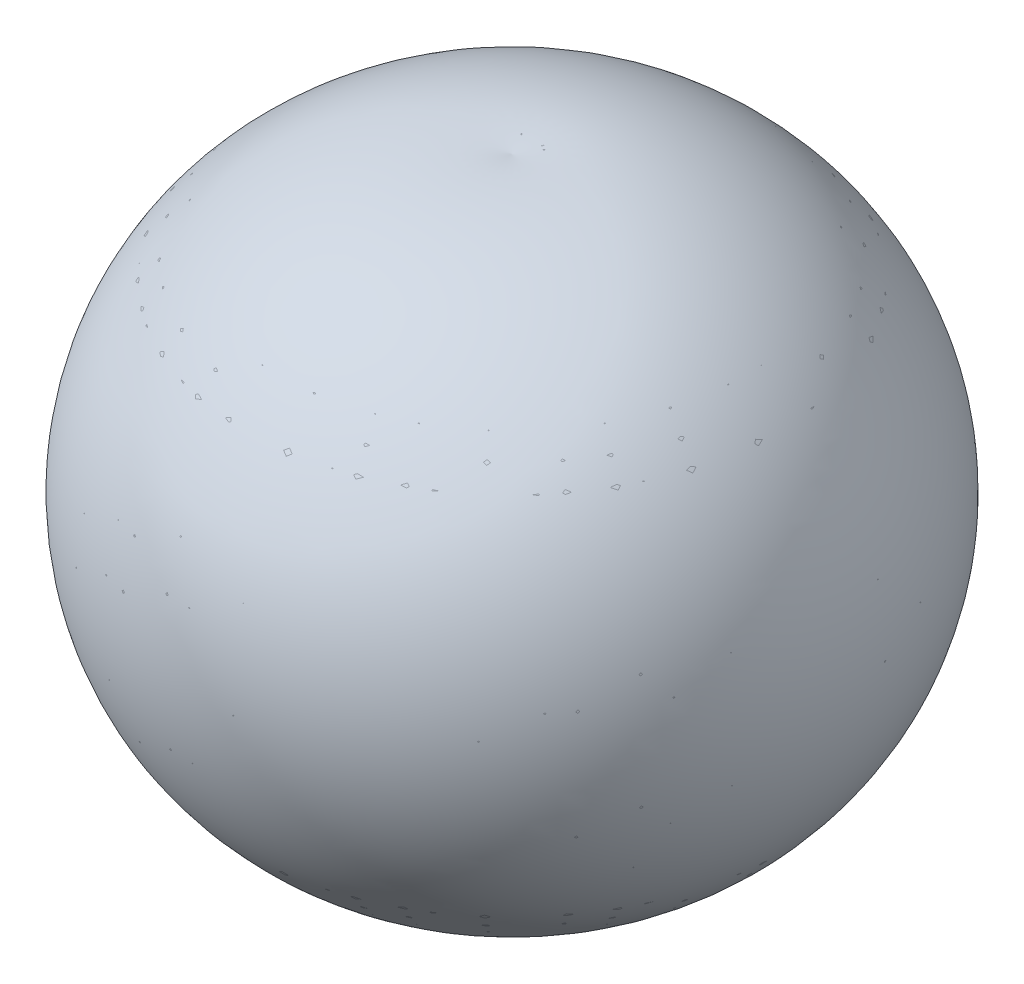
ISO-10303-21;
HEADER;
FILE_DESCRIPTION(('STEP AP214'),'2;1');
FILE_NAME('part.step','',(''),(''),'','','');
FILE_SCHEMA(('AUTOMOTIVE_DESIGN { 1 0 10303 214 1 1 1 1 }'));
ENDSEC;
DATA;
#1=APPLICATION_CONTEXT('core data for automotive mechanical design processes');
#2=APPLICATION_PROTOCOL_DEFINITION('international standard','automotive_design',2000,#1);
#3=PRODUCT_CONTEXT('',#1,'mechanical');
#4=PRODUCT('Part','Part','',(#3));
#5=PRODUCT_RELATED_PRODUCT_CATEGORY('part','',(#4));
#6=PRODUCT_DEFINITION_FORMATION('','',#4);
#7=PRODUCT_DEFINITION_CONTEXT('part definition',#1,'design');
#8=PRODUCT_DEFINITION('design','',#6,#7);
#9=PRODUCT_DEFINITION_SHAPE('','',#8);
#10=(LENGTH_UNIT() NAMED_UNIT(*) SI_UNIT(.MILLI.,.METRE.));
#11=(NAMED_UNIT(*) PLANE_ANGLE_UNIT() SI_UNIT($,.RADIAN.));
#12=(NAMED_UNIT(*) SI_UNIT($,.STERADIAN.) SOLID_ANGLE_UNIT());
#13=UNCERTAINTY_MEASURE_WITH_UNIT(LENGTH_MEASURE(1.E-05),#10,'distance_accuracy_value','');
#14=(GEOMETRIC_REPRESENTATION_CONTEXT(3) GLOBAL_UNCERTAINTY_ASSIGNED_CONTEXT((#13)) GLOBAL_UNIT_ASSIGNED_CONTEXT((#10,
#11,#12)) REPRESENTATION_CONTEXT('',''));
#15=CARTESIAN_POINT('',(0.,0.,0.));
#16=DIRECTION('',(0.,0.,1.));
#17=DIRECTION('',(1.,0.,0.));
#18=AXIS2_PLACEMENT_3D('',#15,#16,#17);
#19=CARTESIAN_POINT('',(0.,450.000001151964,0.));
#20=DIRECTION('',(0.,-1.,0.));
#21=DIRECTION('',(0.,0.,-1.));
#22=AXIS2_PLACEMENT_3D('',#19,#20,#21);
#23=DEGENERATE_TOROIDAL_SURFACE('',#22,149.999999332809,566.923540499677,.F.);
#24=CARTESIAN_POINT('',(0.,982.999252027794,0.));
#25=DIRECTION('',(0.,-1.,0.));
#26=DIRECTION('',(0.,0.,-1.));
#27=AXIS2_PLACEMENT_3D('',#24,#25,#26);
#28=CIRCLE('',#27,43.1685781804391);
#29=CARTESIAN_POINT('',(0.,982.999252027794,-43.1685781804391));
#30=VERTEX_POINT('',#29);
#31=EDGE_CURVE('E61',#30,#30,#28,.T.);
#32=ORIENTED_EDGE('',*,*,#31,.F.);
#33=EDGE_LOOP('',(#32));
#34=FACE_BOUND('',#33,.T.);
#35=CARTESIAN_POINT('',(0.,165.865259273507,0.));
#36=DIRECTION('',(0.,-1.,0.));
#37=DIRECTION('',(0.,0.,-1.));
#38=AXIS2_PLACEMENT_3D('',#35,#36,#37);
#39=CIRCLE('',#38,340.581032944583);
#40=CARTESIAN_POINT('',(0.,165.865259273507,-340.581032944583));
#41=VERTEX_POINT('',#40);
#42=EDGE_CURVE('E12',#41,#41,#39,.T.);
#43=ORIENTED_EDGE('',*,*,#42,.T.);
#44=EDGE_LOOP('',(#43));
#45=FACE_BOUND('',#44,.T.);
#46=ADVANCED_FACE('F41',(#34,#45),#23,.T.);
#47=CARTESIAN_POINT('',(0.,-206.222723073556,0.));
#48=DIRECTION('',(0.,1.,0.));
#49=DIRECTION('',(0.,0.,1.));
#50=AXIS2_PLACEMENT_3D('',#47,#48,#49);
#51=CONICAL_SURFACE('',#50,312.262041537751,0.0759618772199012);
#52=ORIENTED_EDGE('',*,*,#42,.F.);
#53=EDGE_LOOP('',(#52));
#54=FACE_BOUND('',#53,.T.);
#55=CARTESIAN_POINT('',(0.,-206.222723073556,0.));
#56=DIRECTION('',(0.,-1.,0.));
#57=DIRECTION('',(0.,0.,-1.));
#58=AXIS2_PLACEMENT_3D('',#55,#56,#57);
#59=CIRCLE('',#58,312.262041537751);
#60=CARTESIAN_POINT('',(0.,-206.222723073556,-312.262041537751));
#61=VERTEX_POINT('',#60);
#62=EDGE_CURVE('E48',#61,#61,#59,.T.);
#63=ORIENTED_EDGE('',*,*,#62,.T.);
#64=EDGE_LOOP('',(#63));
#65=FACE_BOUND('',#64,.T.);
#66=ADVANCED_FACE('F75',(#54,#65),#51,.F.);
#67=CARTESIAN_POINT('',(0.,450.000001295238,0.));
#68=DIRECTION('',(0.,-1.,0.));
#69=DIRECTION('',(0.,0.,-1.));
#70=AXIS2_PLACEMENT_3D('',#67,#68,#69);
#71=DEGENERATE_TOROIDAL_SURFACE('',#70,450.000000271862,670.522191470381,.T.);
#72=ORIENTED_EDGE('',*,*,#62,.F.);
#73=EDGE_LOOP('',(#72));
#74=FACE_BOUND('',#73,.T.);
#75=CARTESIAN_POINT('',(0.,450.000001455353,0.));
#76=DIRECTION('',(0.,-1.,0.));
#77=DIRECTION('',(0.,0.,-1.));
#78=AXIS2_PLACEMENT_3D('',#75,#76,#77);
#79=CIRCLE('',#78,1120.52219174224);
#80=CARTESIAN_POINT('',(0.,450.000001455353,-1120.52219174224));
#81=VERTEX_POINT('',#80);
#82=EDGE_CURVE('E63',#81,#81,#79,.T.);
#83=ORIENTED_EDGE('',*,*,#82,.T.);
#84=EDGE_LOOP('',(#83));
#85=FACE_BOUND('',#84,.T.);
#86=ADVANCED_FACE('F77',(#74,#85),#71,.T.);
#87=CARTESIAN_POINT('',(0.,450.000001151964,149.999999332809));
#88=DIRECTION('',(-1.,0.,0.));
#89=DIRECTION('',(0.,0.,-1.));
#90=AXIS2_PLACEMENT_3D('',#87,#88,#89);
#91=CIRCLE('',#90,1270.52219107505);
#92=TRIMMED_CURVE('',#91,(PARAMETER_VALUE(-1.45245863189914)),
(PARAMETER_VALUE(1.45245863189914)),.T.,.PARAMETER.);
#93=CARTESIAN_POINT('',(0.,450.000001151964,0.));
#94=DIRECTION('',(0.,-1.,0.));
#95=AXIS1_PLACEMENT('',#93,#94);
#96=SURFACE_OF_REVOLUTION('',#92,#95);
#97=ORIENTED_EDGE('',*,*,#82,.F.);
#98=EDGE_LOOP('',(#97));
#99=FACE_BOUND('',#98,.T.);
#100=CARTESIAN_POINT('',(0.,1711.63649325827,0.));
#101=VERTEX_POINT('',#100);
#102=VERTEX_LOOP('',#101);
#103=FACE_BOUND('',#102,.T.);
#104=ADVANCED_FACE('F57',(#99,#103),#96,.T.);
#105=CARTESIAN_POINT('',(0.,450.000001295238,-450.000000271862));
#106=DIRECTION('',(-1.,0.,0.));
#107=DIRECTION('',(0.,0.,-1.));
#108=AXIS2_PLACEMENT_3D('',#105,#106,#107);
#109=CIRCLE('',#108,670.52219);
#110=TRIMMED_CURVE('',#109,(PARAMETER_VALUE(-2.30651312939054)),
(PARAMETER_VALUE(2.30651312939054)),.T.,.PARAMETER.);
#111=CARTESIAN_POINT('',(0.,450.000001295238,0.));
#112=DIRECTION('',(0.,-1.,0.));
#113=AXIS1_PLACEMENT('',#111,#112);
#114=SURFACE_OF_REVOLUTION('',#110,#113);
#115=CARTESIAN_POINT('',(1.11022302462516E-13,947.091549239598,0.));
#116=VERTEX_POINT('',#115);
#117=VERTEX_LOOP('',#116);
#118=FACE_BOUND('',#117,.T.);
#119=ORIENTED_EDGE('',*,*,#31,.T.);
#120=EDGE_LOOP('',(#119));
#121=FACE_BOUND('',#120,.T.);
#122=ADVANCED_FACE('F54',(#118,#121),#114,.F.);
#123=CLOSED_SHELL('',(#46,#66,#86,#104,#122));
#124=CARTESIAN_POINT('',(0.,450.000001151964,0.));
#125=DIRECTION('',(0.,-1.,0.));
#126=DIRECTION('',(0.,0.,-1.));
#127=AXIS2_PLACEMENT_3D('',#124,#125,#126);
#128=DEGENERATE_TOROIDAL_SURFACE('',#127,149.999999332809,567.923540499677,.F.);
#129=CARTESIAN_POINT('',(0.,984.12519750721,0.));
#130=DIRECTION('',(0.,-1.,0.));
#131=DIRECTION('',(0.,0.,-1.));
#132=AXIS2_PLACEMENT_3D('',#129,#130,#131);
#133=CIRCLE('',#132,42.9959137642226);
#134=CARTESIAN_POINT('',(0.,984.12519750721,-42.9959137642226));
#135=VERTEX_POINT('',#134);
#136=EDGE_CURVE('E64',#135,#135,#133,.T.);
#137=ORIENTED_EDGE('',*,*,#136,.T.);
#138=EDGE_LOOP('',(#137));
#139=FACE_BOUND('',#138,.T.);
#140=CARTESIAN_POINT('',(0.,165.561780960501,0.));
#141=DIRECTION('',(0.,-1.,0.));
#142=DIRECTION('',(0.,0.,-1.));
#143=AXIS2_PLACEMENT_3D('',#140,#141,#142);
#144=CIRCLE('',#143,341.560827776107);
#145=CARTESIAN_POINT('',(0.,165.561780960501,-341.560827776107));
#146=VERTEX_POINT('',#145);
#147=EDGE_CURVE('E179',#146,#146,#144,.T.);
#148=ORIENTED_EDGE('',*,*,#147,.F.);
#149=EDGE_LOOP('',(#148));
#150=FACE_BOUND('',#149,.T.);
#151=ADVANCED_FACE('F117',(#139,#150),#128,.F.);
#152=CARTESIAN_POINT('',(0.,450.000001295238,0.));
#153=DIRECTION('',(0.,-1.,0.));
#154=DIRECTION('',(0.,0.,-1.));
#155=AXIS2_PLACEMENT_3D('',#152,#153,#154);
#156=DEGENERATE_TOROIDAL_SURFACE('',#155,450.000000271862,671.52219,.T.);
#157=CARTESIAN_POINT('',(0.,949.340617927076,0.));
#158=DIRECTION('',(0.,-1.,0.));
#159=DIRECTION('',(0.,0.,-1.));
#160=AXIS2_PLACEMENT_3D('',#157,#158,#159);
#161=CIRCLE('',#160,1.);
#162=CARTESIAN_POINT('',(0.,949.340617927076,-1.));
#163=VERTEX_POINT('',#162);
#164=EDGE_CURVE('E69',#163,#163,#161,.T.);
#165=ORIENTED_EDGE('',*,*,#164,.T.);
#166=EDGE_LOOP('',(#165));
#167=FACE_BOUND('',#166,.T.);
#168=ORIENTED_EDGE('',*,*,#136,.F.);
#169=EDGE_LOOP('',(#168));
#170=FACE_BOUND('',#169,.T.);
#171=ADVANCED_FACE('F120',(#167,#170),#156,.T.);
#172=CARTESIAN_POINT('',(0.,0.,0.));
#173=DIRECTION('',(0.,-1.,0.));
#174=DIRECTION('',(0.,0.,-1.));
#175=AXIS2_PLACEMENT_3D('',#172,#173,#174);
#176=CYLINDRICAL_SURFACE('',#175,1.);
#177=CARTESIAN_POINT('',(0.,1710.51005419934,0.));
#178=DIRECTION('',(0.,-1.,0.));
#179=DIRECTION('',(0.,0.,-1.));
#180=AXIS2_PLACEMENT_3D('',#177,#178,#179);
#181=CIRCLE('',#180,1.);
#182=CARTESIAN_POINT('',(0.,1710.51005419934,-1.));
#183=VERTEX_POINT('',#182);
#184=EDGE_CURVE('E186',#183,#183,#181,.T.);
#185=ORIENTED_EDGE('',*,*,#184,.T.);
#186=EDGE_LOOP('',(#185));
#187=FACE_BOUND('',#186,.T.);
#188=ORIENTED_EDGE('',*,*,#164,.F.);
#189=EDGE_LOOP('',(#188));
#190=FACE_BOUND('',#189,.T.);
#191=ADVANCED_FACE('F131',(#187,#190),#176,.T.);
#192=CARTESIAN_POINT('',(0.,450.000001151964,0.));
#193=DIRECTION('',(0.,-1.,0.));
#194=DIRECTION('',(0.,0.,-1.));
#195=AXIS2_PLACEMENT_3D('',#192,#193,#194);
#196=DEGENERATE_TOROIDAL_SURFACE('',#195,149.999999332809,1269.52219107505,.F.);
#197=CARTESIAN_POINT('',(0.,450.000001455114,0.));
#198=DIRECTION('',(0.,-1.,0.));
#199=DIRECTION('',(0.,0.,-1.));
#200=AXIS2_PLACEMENT_3D('',#197,#198,#199);
#201=CIRCLE('',#200,1119.52219174224);
#202=CARTESIAN_POINT('',(0.,450.000001455114,-1119.52219174224));
#203=VERTEX_POINT('',#202);
#204=EDGE_CURVE('E183',#203,#203,#201,.T.);
#205=ORIENTED_EDGE('',*,*,#204,.T.);
#206=EDGE_LOOP('',(#205));
#207=FACE_BOUND('',#206,.T.);
#208=ORIENTED_EDGE('',*,*,#184,.F.);
#209=EDGE_LOOP('',(#208));
#210=FACE_BOUND('',#209,.T.);
#211=ADVANCED_FACE('F141',(#207,#210),#196,.T.);
#212=CARTESIAN_POINT('',(0.,450.000001295238,0.));
#213=DIRECTION('',(0.,-1.,0.));
#214=DIRECTION('',(0.,0.,-1.));
#215=AXIS2_PLACEMENT_3D('',#212,#213,#214);
#216=DEGENERATE_TOROIDAL_SURFACE('',#215,450.000000271862,669.522191470381,.T.);
#217=CARTESIAN_POINT('',(0.,-205.423613523268,0.));
#218=DIRECTION('',(0.,-1.,0.));
#219=DIRECTION('',(0.,0.,-1.));
#220=AXIS2_PLACEMENT_3D('',#217,#218,#219);
#221=CIRCLE('',#220,313.325752479731);
#222=CARTESIAN_POINT('',(0.,-205.423613523268,-313.325752479731));
#223=VERTEX_POINT('',#222);
#224=EDGE_CURVE('E182',#223,#223,#221,.T.);
#225=ORIENTED_EDGE('',*,*,#224,.T.);
#226=EDGE_LOOP('',(#225));
#227=FACE_BOUND('',#226,.T.);
#228=ORIENTED_EDGE('',*,*,#204,.F.);
#229=EDGE_LOOP('',(#228));
#230=FACE_BOUND('',#229,.T.);
#231=ADVANCED_FACE('F151',(#227,#230),#216,.F.);
#232=CARTESIAN_POINT('',(0.,-205.423613523268,0.));
#233=DIRECTION('',(0.,1.,0.));
#234=DIRECTION('',(0.,0.,1.));
#235=AXIS2_PLACEMENT_3D('',#232,#233,#234);
#236=CONICAL_SURFACE('',#235,313.325752479731,0.0759618772199008);
#237=ORIENTED_EDGE('',*,*,#147,.T.);
#238=EDGE_LOOP('',(#237));
#239=FACE_BOUND('',#238,.T.);
#240=ORIENTED_EDGE('',*,*,#224,.F.);
#241=EDGE_LOOP('',(#240));
#242=FACE_BOUND('',#241,.T.);
#243=ADVANCED_FACE('F161',(#239,#242),#236,.T.);
#244=CLOSED_SHELL('',(#151,#171,#191,#211,#231,#243));
#245=ORIENTED_CLOSED_SHELL('',*,#244,.T.);
#246=BREP_WITH_VOIDS('B2',#123,(#245));
#247=CARTESIAN_POINT('',(150.000000000002,450.000000000002,0.));
#248=DIRECTION('',(0.,0.,-1.));
#249=DIRECTION('',(1.,0.,0.));
#250=AXIS2_PLACEMENT_3D('',#247,#248,#249);
#251=CIRCLE('',#250,1270.52219287594);
#252=TRIMMED_CURVE('',#251,(PARAMETER_VALUE(-1.68913402205097)),
(PARAMETER_VALUE(1.68913402205097)),.T.,.PARAMETER.);
#253=CARTESIAN_POINT('',(0.,450.000000000002,0.));
#254=DIRECTION('',(0.,-1.,0.));
#255=AXIS1_PLACEMENT('',#253,#254);
#256=SURFACE_OF_REVOLUTION('',#252,#255);
#257=CARTESIAN_POINT('',(0.,1711.63649384055,0.));
#258=VERTEX_POINT('',#257);
#259=VERTEX_LOOP('',#258);
#260=FACE_BOUND('',#259,.T.);
#261=CARTESIAN_POINT('',(0.,-743.900328226891,0.));
#262=DIRECTION('',(0.,-1.,0.));
#263=DIRECTION('',(1.,0.,0.));
#264=AXIS2_PLACEMENT_3D('',#261,#262,#263);
#265=CIRCLE('',#264,584.544185152668);
#266=CARTESIAN_POINT('',(584.544185152668,-743.900328226891,0.));
#267=VERTEX_POINT('',#266);
#268=EDGE_CURVE('E219',#267,#267,#265,.T.);
#269=ORIENTED_EDGE('',*,*,#268,.F.);
#270=EDGE_LOOP('',(#269));
#271=FACE_BOUND('',#270,.T.);
#272=ADVANCED_FACE('F210',(#260,#271),#256,.T.);
#273=CARTESIAN_POINT('',(355.21208943322,-113.815578027741,0.));
#274=DIRECTION('',(0.,0.,-1.));
#275=DIRECTION('',(1.,0.,0.));
#276=AXIS2_PLACEMENT_3D('',#273,#274,#275);
#277=CIRCLE('',#276,670.522186479015);
#278=TRIMMED_CURVE('',#277,(PARAMETER_VALUE(-2.12910731397055)),
(PARAMETER_VALUE(2.12910731397055)),.T.,.PARAMETER.);
#279=CARTESIAN_POINT('',(0.,-113.815578027741,0.));
#280=DIRECTION('',(0.,-1.,0.));
#281=AXIS1_PLACEMENT('',#279,#280);
#282=SURFACE_OF_REVOLUTION('',#278,#281);
#283=ORIENTED_EDGE('',*,*,#268,.T.);
#284=EDGE_LOOP('',(#283));
#285=FACE_BOUND('',#284,.T.);
#286=CARTESIAN_POINT('',(-2.10803898046994E-13,-682.519696248355,0.));
#287=VERTEX_POINT('',#286);
#288=VERTEX_LOOP('',#287);
#289=FACE_BOUND('',#288,.T.);
#290=ADVANCED_FACE('F267',(#285,#289),#282,.T.);
#291=CLOSED_SHELL('',(#272,#290));
#292=CARTESIAN_POINT('',(0.,450.000000000002,0.));
#293=DIRECTION('',(0.,-1.,0.));
#294=DIRECTION('',(1.,0.,0.));
#295=AXIS2_PLACEMENT_3D('',#292,#293,#294);
#296=DEGENERATE_TOROIDAL_SURFACE('',#295,150.000000000002,203.96078377182,.T.);
#297=CARTESIAN_POINT('',(0.,290.800695191244,0.));
#298=DIRECTION('',(0.,-1.,0.));
#299=DIRECTION('',(1.,0.,0.));
#300=AXIS2_PLACEMENT_3D('',#297,#298,#299);
#301=CIRCLE('',#300,277.497382974019);
#302=CARTESIAN_POINT('',(277.497382974019,290.800695191244,0.));
#303=VERTEX_POINT('',#302);
#304=EDGE_CURVE('E247',#303,#303,#301,.T.);
#305=ORIENTED_EDGE('',*,*,#304,.T.);
#306=EDGE_LOOP('',(#305));
#307=FACE_BOUND('',#306,.T.);
#308=CARTESIAN_POINT('',(0.,650.000002297776,0.));
#309=DIRECTION('',(0.,-1.,0.));
#310=DIRECTION('',(1.,0.,0.));
#311=AXIS2_PLACEMENT_3D('',#308,#309,#310);
#312=CIRCLE('',#311,190.000004971319);
#313=CARTESIAN_POINT('',(190.000004971319,650.000002297776,0.));
#314=VERTEX_POINT('',#313);
#315=EDGE_CURVE('E38',#314,#314,#312,.T.);
#316=ORIENTED_EDGE('',*,*,#315,.F.);
#317=EDGE_LOOP('',(#316));
#318=FACE_BOUND('',#317,.T.);
#319=ADVANCED_FACE('F212',(#307,#318),#296,.F.);
#320=CARTESIAN_POINT('',(-449.999999999998,450.000000000002,0.));
#321=DIRECTION('',(0.,0.,-1.));
#322=DIRECTION('',(1.,0.,0.));
#323=AXIS2_PLACEMENT_3D('',#320,#321,#322);
#324=CIRCLE('',#323,670.52219);
#325=TRIMMED_CURVE('',#324,(PARAMETER_VALUE(-0.835079524746159)),
(PARAMETER_VALUE(0.835079524746159)),.T.,.PARAMETER.);
#326=CARTESIAN_POINT('',(0.,450.000000000002,0.));
#327=DIRECTION('',(0.,-1.,0.));
#328=AXIS1_PLACEMENT('',#326,#327);
#329=SURFACE_OF_REVOLUTION('',#325,#328);
#330=ORIENTED_EDGE('',*,*,#315,.T.);
#331=EDGE_LOOP('',(#330));
#332=FACE_BOUND('',#331,.T.);
#333=CARTESIAN_POINT('',(1.7245373647393E-13,947.091548190471,0.));
#334=VERTEX_POINT('',#333);
#335=VERTEX_LOOP('',#334);
#336=FACE_BOUND('',#335,.T.);
#337=ADVANCED_FACE('F236',(#332,#336),#329,.F.);
#338=CARTESIAN_POINT('',(-262.446039726358,-10.3163432048402,-1.83265090031572E-12));
#339=CARTESIAN_POINT('',(-251.952539530693,-35.2125626278176,-1.75937518009111E-12));
#340=CARTESIAN_POINT('',(-212.125849132438,-111.334609819919,-1.48126688746432E-12));
#341=CARTESIAN_POINT('',(-121.839984289819,-201.58377993004,-8.50804062945689E-13));
#342=CARTESIAN_POINT('',(-35.9740015503306,-249.290633733612,-2.51205110192987E-13));
#343=CARTESIAN_POINT('',(0.,-264.76734483129,0.));
#344=B_SPLINE_CURVE_WITH_KNOTS('',3,(#338,#339,#340,#341,#342,#343),.UNSPECIFIED.,.F.,.F.,(4,1,
1,4),(290.158825992064,371.210769776428,546.377489550073,663.327227075659),.UNSPECIFIED.);
#345=CARTESIAN_POINT('',(0.,0.,0.));
#346=DIRECTION('',(0.,-1.,0.));
#347=AXIS1_PLACEMENT('',#345,#346);
#348=SURFACE_OF_REVOLUTION('',#344,#347);
#349=CARTESIAN_POINT('',(0.,-264.76734483129,0.));
#350=VERTEX_POINT('',#349);
#351=VERTEX_LOOP('',#350);
#352=FACE_BOUND('',#351,.T.);
#353=CARTESIAN_POINT('',(0.,-10.3163432048402,0.));
#354=DIRECTION('',(0.,-1.,0.));
#355=DIRECTION('',(1.,0.,0.));
#356=AXIS2_PLACEMENT_3D('',#353,#354,#355);
#357=CIRCLE('',#356,262.446039726358);
#358=CARTESIAN_POINT('',(262.446039726358,-10.3163432048402,0.));
#359=VERTEX_POINT('',#358);
#360=EDGE_CURVE('E241',#359,#359,#357,.T.);
#361=ORIENTED_EDGE('',*,*,#360,.F.);
#362=EDGE_LOOP('',(#361));
#363=FACE_BOUND('',#362,.T.);
#364=ADVANCED_FACE('F232',(#352,#363),#348,.F.);
#365=CARTESIAN_POINT('',(-257.017743528519,194.813008703886,-1.79474531056279E-12));
#366=CARTESIAN_POINT('',(-260.841153684039,181.95917171536,-1.82144404098027E-12));
#367=CARTESIAN_POINT('',(-270.498210538382,142.258664964535,-1.88887890857044E-12));
#368=CARTESIAN_POINT('',(-275.850539155613,72.8859309173548,-1.92625401954328E-12));
#369=CARTESIAN_POINT('',(-268.813103331774,17.2373699567389,-1.8771118678388E-12));
#370=CARTESIAN_POINT('',(-262.446039726358,-10.3163432048402,-1.83265090031572E-12));
#371=B_SPLINE_CURVE_WITH_KNOTS('',3,(#365,#366,#367,#368,#369,#370),.UNSPECIFIED.,.F.,.F.,(4,1,
1,4),(0.,40.2312852753409,122.345481528922,207.184856064045),.UNSPECIFIED.);
#372=CARTESIAN_POINT('',(0.,0.,0.));
#373=DIRECTION('',(0.,-1.,0.));
#374=AXIS1_PLACEMENT('',#372,#373);
#375=SURFACE_OF_REVOLUTION('',#371,#374);
#376=ORIENTED_EDGE('',*,*,#360,.T.);
#377=EDGE_LOOP('',(#376));
#378=FACE_BOUND('',#377,.T.);
#379=CARTESIAN_POINT('',(0.,194.813008703886,0.));
#380=DIRECTION('',(0.,-1.,0.));
#381=DIRECTION('',(1.,0.,0.));
#382=AXIS2_PLACEMENT_3D('',#379,#380,#381);
#383=CIRCLE('',#382,257.017743528519);
#384=CARTESIAN_POINT('',(257.017743528519,194.813008703886,0.));
#385=VERTEX_POINT('',#384);
#386=EDGE_CURVE('E243',#385,#385,#383,.T.);
#387=ORIENTED_EDGE('',*,*,#386,.F.);
#388=EDGE_LOOP('',(#387));
#389=FACE_BOUND('',#388,.T.);
#390=ADVANCED_FACE('F235',(#378,#389),#375,.F.);
#391=CARTESIAN_POINT('',(0.,290.800695191244,0.));
#392=DIRECTION('',(0.,1.,0.));
#393=DIRECTION('',(-1.,0.,0.));
#394=AXIS2_PLACEMENT_3D('',#391,#392,#393);
#395=CONICAL_SURFACE('',#394,277.497382974019,0.21020516939689);
#396=ORIENTED_EDGE('',*,*,#386,.T.);
#397=EDGE_LOOP('',(#396));
#398=FACE_BOUND('',#397,.T.);
#399=ORIENTED_EDGE('',*,*,#304,.F.);
#400=EDGE_LOOP('',(#399));
#401=FACE_BOUND('',#400,.T.);
#402=ADVANCED_FACE('F296',(#398,#401),#395,.F.);
#403=CLOSED_SHELL('',(#319,#337,#364,#390,#402));
#404=CARTESIAN_POINT('',(0.,450.000000000002,0.));
#405=DIRECTION('',(0.,-1.,0.));
#406=DIRECTION('',(1.,0.,0.));
#407=AXIS2_PLACEMENT_3D('',#404,#405,#406);
#408=DEGENERATE_TOROIDAL_SURFACE('',#407,150.000000000002,204.96078377182,.T.);
#409=CARTESIAN_POINT('',(0.,290.243633998528,0.));
#410=DIRECTION('',(0.,-1.,0.));
#411=DIRECTION('',(1.,0.,0.));
#412=AXIS2_PLACEMENT_3D('',#409,#410,#411);
#413=CIRCLE('',#412,278.401037403761);
#414=CARTESIAN_POINT('',(278.401037403761,290.243633998528,0.));
#415=VERTEX_POINT('',#414);
#416=EDGE_CURVE('E252',#415,#415,#413,.T.);
#417=ORIENTED_EDGE('',*,*,#416,.F.);
#418=EDGE_LOOP('',(#417));
#419=FACE_BOUND('',#418,.T.);
#420=CARTESIAN_POINT('',(0.,650.863410371378,0.));
#421=DIRECTION('',(0.,-1.,0.));
#422=DIRECTION('',(1.,0.,0.));
#423=AXIS2_PLACEMENT_3D('',#420,#421,#422);
#424=CIRCLE('',#423,190.777607315033);
#425=CARTESIAN_POINT('',(190.777607315033,650.863410371378,0.));
#426=VERTEX_POINT('',#425);
#427=EDGE_CURVE('E434',#426,#426,#424,.T.);
#428=ORIENTED_EDGE('',*,*,#427,.T.);
#429=EDGE_LOOP('',(#428));
#430=FACE_BOUND('',#429,.T.);
#431=ADVANCED_FACE('F281',(#419,#430),#408,.T.);
#432=CARTESIAN_POINT('',(0.,290.243633998528,0.));
#433=DIRECTION('',(0.,1.,0.));
#434=DIRECTION('',(-1.,0.,0.));
#435=AXIS2_PLACEMENT_3D('',#432,#433,#434);
#436=CONICAL_SURFACE('',#435,278.401037403761,0.210205169396885);
#437=CARTESIAN_POINT('',(0.,194.853550421947,0.));
#438=DIRECTION('',(0.,-1.,0.));
#439=DIRECTION('',(1.,0.,0.));
#440=AXIS2_PLACEMENT_3D('',#437,#438,#439);
#441=CIRCLE('',#440,258.048900688999);
#442=CARTESIAN_POINT('',(258.048900688999,194.853550421947,0.));
#443=VERTEX_POINT('',#442);
#444=EDGE_CURVE('E458',#443,#443,#441,.T.);
#445=ORIENTED_EDGE('',*,*,#444,.F.);
#446=EDGE_LOOP('',(#445));
#447=FACE_BOUND('',#446,.T.);
#448=ORIENTED_EDGE('',*,*,#416,.T.);
#449=EDGE_LOOP('',(#448));
#450=FACE_BOUND('',#449,.T.);
#451=ADVANCED_FACE('F283',(#447,#450),#436,.T.);
#452=CARTESIAN_POINT('',(-258.048900688999,194.853550421947,-1.80194584252925E-12));
#453=CARTESIAN_POINT('',(-260.520861644482,186.523616237729,-1.81920745362209E-12));
#454=CARTESIAN_POINT('',(-262.715424609853,178.131298937232,-1.8345320049031E-12));
#455=CARTESIAN_POINT('',(-266.535328625776,161.218653902975,-1.86120625207864E-12));
#456=CARTESIAN_POINT('',(-268.158402047528,152.697816209675,-1.87254011320588E-12));
#457=CARTESIAN_POINT('',(-270.823512324608,135.525473431899,-1.89115047880265E-12));
#458=CARTESIAN_POINT('',(-271.86245962948,126.911334255628,-1.89840540905665E-12));
#459=CARTESIAN_POINT('',(-273.373153361947,109.636890508487,-1.90895452700788E-12));
#460=CARTESIAN_POINT('',(-273.845078342755,100.975271723371,-1.91224996153553E-12));
#461=CARTESIAN_POINT('',(-274.136105401249,87.946960266606,-1.91428219262319E-12));
#462=CARTESIAN_POINT('',(-274.163290316326,83.6080741504684,-1.91447202387057E-12));
#463=CARTESIAN_POINT('',(-274.080750768007,74.9478275839346,-1.91389565328522E-12));
#464=CARTESIAN_POINT('',(-273.971091049217,70.6248473390392,-1.91312990356167E-12));
#465=CARTESIAN_POINT('',(-273.440001639249,57.6770161593402,-1.90942132603334E-12));
#466=CARTESIAN_POINT('',(-272.816667069411,49.073253328986,-1.90506860399646E-12));
#467=CARTESIAN_POINT('',(-270.15059238016,23.3451110604489,-1.88645150394549E-12));
#468=CARTESIAN_POINT('',(-267.312934733357,6.30375737160721,-1.86663624650582E-12));
#469=CARTESIAN_POINT('',(-263.400977056499,-10.6253902556752,-1.83931919205163E-12));
#470=B_SPLINE_CURVE_WITH_KNOTS('',3,(#452,#453,#454,#455,#456,#457,#458,#459,#460,#461,#462,
#463,#464,#465,#466,#467,#468,#469),.UNSPECIFIED.,.F.,.F.,(4,2,2,2,2,2,2,2,4),(0.,0.125,0.25,
0.375,0.5,0.5625,0.625,0.75,1.),.UNSPECIFIED.);
#471=CARTESIAN_POINT('',(0.,0.,0.));
#472=DIRECTION('',(0.,-1.,0.));
#473=AXIS1_PLACEMENT('',#471,#472);
#474=SURFACE_OF_REVOLUTION('',#470,#473);
#475=CARTESIAN_POINT('',(0.,-10.6253902556753,0.));
#476=DIRECTION('',(0.,-1.,0.));
#477=DIRECTION('',(1.,0.,0.));
#478=AXIS2_PLACEMENT_3D('',#475,#476,#477);
#479=CIRCLE('',#478,263.400977056499);
#480=CARTESIAN_POINT('',(263.400977056499,-10.6253902556753,0.));
#481=VERTEX_POINT('',#480);
#482=EDGE_CURVE('E455',#481,#481,#479,.T.);
#483=ORIENTED_EDGE('',*,*,#482,.F.);
#484=EDGE_LOOP('',(#483));
#485=FACE_BOUND('',#484,.T.);
#486=ORIENTED_EDGE('',*,*,#444,.T.);
#487=EDGE_LOOP('',(#486));
#488=FACE_BOUND('',#487,.T.);
#489=ADVANCED_FACE('F290',(#485,#488),#474,.T.);
#490=CARTESIAN_POINT('',(-263.400977056499,-10.6253902556753,-1.83931919205163E-12));
#491=CARTESIAN_POINT('',(-257.291925583271,-25.1193420456197,-1.79665991361802E-12));
#492=CARTESIAN_POINT('',(-250.518210445906,-39.2466968679627,-1.74935931362451E-12));
#493=CARTESIAN_POINT('',(-239.279677616886,-59.8431774002207,-1.67088105832752E-12));
#494=CARTESIAN_POINT('',(-235.353991487261,-66.6096625212817,-1.64346813860003E-12));
#495=CARTESIAN_POINT('',(-227.125929275282,-79.9348684431209,-1.58601188726411E-12));
#496=CARTESIAN_POINT('',(-222.821460854968,-86.4924352094712,-1.55595394493777E-12));
#497=CARTESIAN_POINT('',(-217.199823036913,-94.5564406502797,-1.51669825786683E-12));
#498=CARTESIAN_POINT('',(-216.063112360702,-96.1632303997552,-1.50876064963951E-12));
#499=CARTESIAN_POINT('',(-213.771668521553,-99.3557676728918,-1.49275958283273E-12));
#500=CARTESIAN_POINT('',(-212.616304101272,-100.942439241789,-1.48469171620677E-12));
#501=CARTESIAN_POINT('',(-209.121729099035,-105.674106405885,-1.46028922939178E-12));
#502=CARTESIAN_POINT('',(-206.754044871826,-108.790762516478,-1.44375577880063E-12));
#503=CARTESIAN_POINT('',(-199.540351503724,-118.030611472845,-1.3933828272429E-12));
#504=CARTESIAN_POINT('',(-194.583814912557,-124.043797645869,-1.3587715172162E-12));
#505=CARTESIAN_POINT('',(-179.293673140173,-141.664805606979,-1.25200102788311E-12));
#506=CARTESIAN_POINT('',(-168.541012290314,-152.855546211248,-1.17691559848273E-12));
#507=CARTESIAN_POINT('',(-145.992993178626,-174.199242935545,-1.01946362257005E-12));
#508=CARTESIAN_POINT('',(-134.1974597613,-184.352024725367,-9.37095852953465E-13));
#509=CARTESIAN_POINT('',(-118.819959956781,-196.412901857671,-8.29715345742381E-13));
#510=CARTESIAN_POINT('',(-115.7126994478,-198.793466383762,-8.08017461578319E-13));
#511=CARTESIAN_POINT('',(-109.434700124001,-203.491416223905,-7.64178426609685E-13));
#512=CARTESIAN_POINT('',(-106.261289393566,-205.810632274642,-7.42018617918091E-13));
#513=CARTESIAN_POINT('',(-96.6820085592215,-212.647814490436,-6.75126857372788E-13));
#514=CARTESIAN_POINT('',(-90.2084151473462,-217.052219527017,-6.29921996187147E-13));
#515=CARTESIAN_POINT('',(-70.5333223439305,-229.818189159283,-4.92531557460882E-13));
#516=CARTESIAN_POINT('',(-57.0779736949953,-237.733323075915,-3.98573360030111E-13));
#517=CARTESIAN_POINT('',(-29.5203121640153,-252.425810618326,-2.06139238074967E-13));
#518=CARTESIAN_POINT('',(-15.4179644400181,-259.203102969488,-1.0766307025054E-13));
#519=CARTESIAN_POINT('',(-0.999999999999959,-265.425337621052,0.));
#520=B_SPLINE_CURVE_WITH_KNOTS('',3,(#490,#491,#492,#493,#494,#495,#496,#497,#498,#499,#500,
#501,#502,#503,#504,#505,#506,#507,#508,#509,#510,#511,#512,#513,#514,#515,#516,#517,#518,#519),
.UNSPECIFIED.,.F.,.F.,(4,2,2,2,2,2,2,2,2,2,2,2,2,2,4),(0.,0.125,0.1875,0.25,0.265625,0.28125,
0.3125,0.375,0.500000000000001,0.625000000000001,0.656250000000001,0.687500000000001,
0.750000000000001,0.875,1.),.UNSPECIFIED.);
#521=CARTESIAN_POINT('',(0.,0.,0.));
#522=DIRECTION('',(0.,-1.,0.));
#523=AXIS1_PLACEMENT('',#521,#522);
#524=SURFACE_OF_REVOLUTION('',#520,#523);
#525=CARTESIAN_POINT('',(0.,-265.425337621052,0.));
#526=DIRECTION('',(0.,-1.,0.));
#527=DIRECTION('',(1.,0.,0.));
#528=AXIS2_PLACEMENT_3D('',#525,#526,#527);
#529=CIRCLE('',#528,0.999999999999989);
#530=CARTESIAN_POINT('',(0.99999999999998,-265.425337621052,0.));
#531=VERTEX_POINT('',#530);
#532=EDGE_CURVE('E452',#531,#531,#529,.T.);
#533=ORIENTED_EDGE('',*,*,#532,.F.);
#534=EDGE_LOOP('',(#533));
#535=FACE_BOUND('',#534,.T.);
#536=ORIENTED_EDGE('',*,*,#482,.T.);
#537=EDGE_LOOP('',(#536));
#538=FACE_BOUND('',#537,.T.);
#539=ADVANCED_FACE('F360',(#535,#538),#524,.T.);
#540=CARTESIAN_POINT('',(0.,0.,0.));
#541=DIRECTION('',(0.,-1.,0.));
#542=DIRECTION('',(1.,0.,0.));
#543=AXIS2_PLACEMENT_3D('',#540,#541,#542);
#544=CYLINDRICAL_SURFACE('',#543,1.00000000000001);
#545=CARTESIAN_POINT('',(0.,-681.96498961504,0.));
#546=DIRECTION('',(0.,-1.,0.));
#547=DIRECTION('',(1.,0.,0.));
#548=AXIS2_PLACEMENT_3D('',#545,#546,#547);
#549=CIRCLE('',#548,1.00000000000002);
#550=CARTESIAN_POINT('',(1.,-681.96498961504,0.));
#551=VERTEX_POINT('',#550);
#552=EDGE_CURVE('E449',#551,#551,#549,.T.);
#553=ORIENTED_EDGE('',*,*,#552,.F.);
#554=EDGE_LOOP('',(#553));
#555=FACE_BOUND('',#554,.T.);
#556=ORIENTED_EDGE('',*,*,#532,.T.);
#557=EDGE_LOOP('',(#556));
#558=FACE_BOUND('',#557,.T.);
#559=ADVANCED_FACE('F368',(#555,#558),#544,.T.);
#560=CARTESIAN_POINT('',(0.,-113.815578027741,0.));
#561=DIRECTION('',(0.,-1.,0.));
#562=DIRECTION('',(1.,0.,0.));
#563=AXIS2_PLACEMENT_3D('',#560,#561,#562);
#564=DEGENERATE_TOROIDAL_SURFACE('',#563,355.21208943322,669.522186479015,.T.);
#565=CARTESIAN_POINT('',(0.,-742.960635606863,0.));
#566=DIRECTION('',(0.,-1.,0.));
#567=DIRECTION('',(1.,0.,0.));
#568=AXIS2_PLACEMENT_3D('',#565,#566,#567);
#569=CIRCLE('',#568,584.202165007259);
#570=CARTESIAN_POINT('',(584.202165007259,-742.960635606863,0.));
#571=VERTEX_POINT('',#570);
#572=EDGE_CURVE('E446',#571,#571,#569,.T.);
#573=ORIENTED_EDGE('',*,*,#572,.F.);
#574=EDGE_LOOP('',(#573));
#575=FACE_BOUND('',#574,.T.);
#576=ORIENTED_EDGE('',*,*,#552,.T.);
#577=EDGE_LOOP('',(#576));
#578=FACE_BOUND('',#577,.T.);
#579=ADVANCED_FACE('F377',(#575,#578),#564,.F.);
#580=CARTESIAN_POINT('',(0.,450.000000000002,0.));
#581=DIRECTION('',(0.,-1.,0.));
#582=DIRECTION('',(1.,0.,0.));
#583=AXIS2_PLACEMENT_3D('',#580,#581,#582);
#584=DEGENERATE_TOROIDAL_SURFACE('',#583,150.000000000002,1269.52219287594,.T.);
#585=CARTESIAN_POINT('',(0.,1710.74803121184,0.));
#586=DIRECTION('',(0.,-1.,0.));
#587=DIRECTION('',(1.,0.,0.));
#588=AXIS2_PLACEMENT_3D('',#585,#586,#587);
#589=CIRCLE('',#588,1.);
#590=CARTESIAN_POINT('',(1.00000000000006,1710.74803121184,0.));
#591=VERTEX_POINT('',#590);
#592=EDGE_CURVE('E443',#591,#591,#589,.T.);
#593=ORIENTED_EDGE('',*,*,#592,.F.);
#594=EDGE_LOOP('',(#593));
#595=FACE_BOUND('',#594,.T.);
#596=ORIENTED_EDGE('',*,*,#572,.T.);
#597=EDGE_LOOP('',(#596));
#598=FACE_BOUND('',#597,.T.);
#599=ADVANCED_FACE('F386',(#595,#598),#584,.F.);
#600=CARTESIAN_POINT('',(0.,0.,0.));
#601=DIRECTION('',(0.,-1.,0.));
#602=DIRECTION('',(1.,0.,0.));
#603=AXIS2_PLACEMENT_3D('',#600,#601,#602);
#604=CYLINDRICAL_SURFACE('',#603,0.999999999999929);
#605=CARTESIAN_POINT('',(0.,947.534975315705,0.));
#606=DIRECTION('',(0.,-1.,0.));
#607=DIRECTION('',(1.,0.,0.));
#608=AXIS2_PLACEMENT_3D('',#605,#606,#607);
#609=CIRCLE('',#608,0.999999999999858);
#610=CARTESIAN_POINT('',(0.999999999999889,947.534975315705,0.));
#611=VERTEX_POINT('',#610);
#612=EDGE_CURVE('E440',#611,#611,#609,.T.);
#613=ORIENTED_EDGE('',*,*,#612,.F.);
#614=EDGE_LOOP('',(#613));
#615=FACE_BOUND('',#614,.T.);
#616=ORIENTED_EDGE('',*,*,#592,.T.);
#617=EDGE_LOOP('',(#616));
#618=FACE_BOUND('',#617,.T.);
#619=ADVANCED_FACE('F395',(#615,#618),#604,.T.);
#620=CARTESIAN_POINT('',(0.,450.000000000002,0.));
#621=DIRECTION('',(0.,-1.,0.));
#622=DIRECTION('',(1.,0.,0.));
#623=AXIS2_PLACEMENT_3D('',#620,#621,#622);
#624=DEGENERATE_TOROIDAL_SURFACE('',#623,449.999999999998,671.52219,.F.);
#625=ORIENTED_EDGE('',*,*,#427,.F.);
#626=EDGE_LOOP('',(#625));
#627=FACE_BOUND('',#626,.T.);
#628=ORIENTED_EDGE('',*,*,#612,.T.);
#629=EDGE_LOOP('',(#628));
#630=FACE_BOUND('',#629,.T.);
#631=ADVANCED_FACE('F404',(#627,#630),#624,.F.);
#632=CLOSED_SHELL('',(#431,#451,#489,#539,#559,#579,#599,#619,#631));
#633=ORIENTED_CLOSED_SHELL('',*,#403,.T.);
#634=ORIENTED_CLOSED_SHELL('',*,#632,.T.);
#635=BREP_WITH_VOIDS('B6',#291,(#633,#634));
#636=ADVANCED_BREP_SHAPE_REPRESENTATION('',(#18,#246,#635),#14);
#637=SHAPE_DEFINITION_REPRESENTATION(#9,#636);
ENDSEC;
END-ISO-10303-21;
